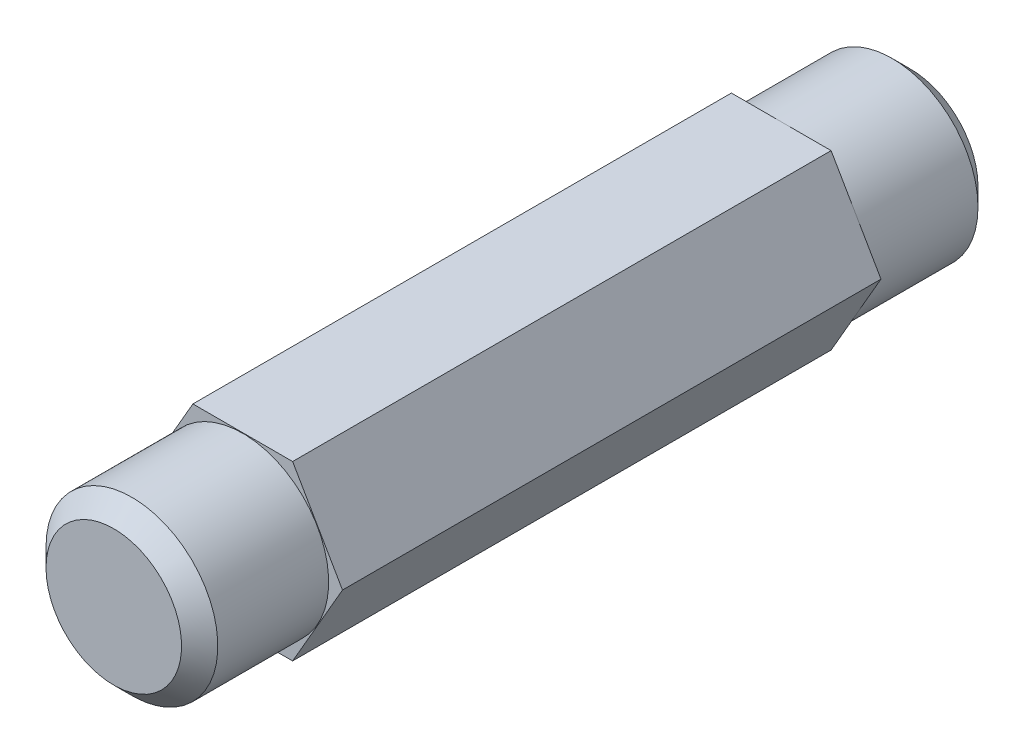
ISO-10303-21;
HEADER;
FILE_DESCRIPTION(('STEP AP214'),'2;1');
FILE_NAME('part.step','',(''),(''),'','','');
FILE_SCHEMA(('AUTOMOTIVE_DESIGN { 1 0 10303 214 1 1 1 1 }'));
ENDSEC;
DATA;
#1=APPLICATION_CONTEXT('core data for automotive mechanical design processes');
#2=APPLICATION_PROTOCOL_DEFINITION('international standard','automotive_design',2000,#1);
#3=PRODUCT_CONTEXT('',#1,'mechanical');
#4=PRODUCT('Part','Part','',(#3));
#5=PRODUCT_RELATED_PRODUCT_CATEGORY('part','',(#4));
#6=PRODUCT_DEFINITION_FORMATION('','',#4);
#7=PRODUCT_DEFINITION_CONTEXT('part definition',#1,'design');
#8=PRODUCT_DEFINITION('design','',#6,#7);
#9=PRODUCT_DEFINITION_SHAPE('','',#8);
#10=(LENGTH_UNIT() NAMED_UNIT(*) SI_UNIT(.MILLI.,.METRE.));
#11=(NAMED_UNIT(*) PLANE_ANGLE_UNIT() SI_UNIT($,.RADIAN.));
#12=(NAMED_UNIT(*) SI_UNIT($,.STERADIAN.) SOLID_ANGLE_UNIT());
#13=UNCERTAINTY_MEASURE_WITH_UNIT(LENGTH_MEASURE(1.E-05),#10,'distance_accuracy_value','');
#14=(GEOMETRIC_REPRESENTATION_CONTEXT(3) GLOBAL_UNCERTAINTY_ASSIGNED_CONTEXT((#13)) GLOBAL_UNIT_ASSIGNED_CONTEXT((#10,
#11,#12)) REPRESENTATION_CONTEXT('',''));
#15=CARTESIAN_POINT('',(0.,0.,0.));
#16=DIRECTION('',(0.,0.,1.));
#17=DIRECTION('',(1.,0.,0.));
#18=AXIS2_PLACEMENT_3D('',#15,#16,#17);
#19=CARTESIAN_POINT('',(0.,0.,21.9583));
#20=DIRECTION('',(0.,0.,1.));
#21=DIRECTION('',(1.,0.,0.));
#22=AXIS2_PLACEMENT_3D('',#19,#20,#21);
#23=PLANE('',#22);
#24=CARTESIAN_POINT('',(0.,0.,21.9582999999943));
#25=DIRECTION('',(0.,0.,-1.));
#26=DIRECTION('',(-1.,0.,0.));
#27=AXIS2_PLACEMENT_3D('',#24,#25,#26);
#28=CIRCLE('',#27,3.73710000002347);
#29=CARTESIAN_POINT('',(-3.73710000002347,0.,21.9582999999943));
#30=VERTEX_POINT('',#29);
#31=EDGE_CURVE('E19',#30,#30,#28,.T.);
#32=ORIENTED_EDGE('',*,*,#31,.F.);
#33=EDGE_LOOP('',(#32));
#34=FACE_BOUND('',#33,.T.);
#35=ADVANCED_FACE('F16',(#34),#23,.T.);
#36=CARTESIAN_POINT('',(0.,0.,-21.9583));
#37=DIRECTION('',(0.,0.,-1.));
#38=DIRECTION('',(-1.,0.,0.));
#39=AXIS2_PLACEMENT_3D('',#36,#37,#38);
#40=PLANE('',#39);
#41=CARTESIAN_POINT('',(0.,0.,-21.9583000000512));
#42=DIRECTION('',(0.,0.,1.));
#43=DIRECTION('',(1.,0.,0.));
#44=AXIS2_PLACEMENT_3D('',#41,#42,#43);
#45=CIRCLE('',#44,3.73709999996663);
#46=CARTESIAN_POINT('',(3.73709999996663,0.,-21.9583000000512));
#47=VERTEX_POINT('',#46);
#48=EDGE_CURVE('E105',#47,#47,#45,.T.);
#49=ORIENTED_EDGE('',*,*,#48,.F.);
#50=EDGE_LOOP('',(#49));
#51=FACE_BOUND('',#50,.T.);
#52=ADVANCED_FACE('F123',(#51),#40,.T.);
#53=CARTESIAN_POINT('',(0.,0.,20.9582999999043));
#54=DIRECTION('',(0.,0.,-1.));
#55=DIRECTION('',(-1.,0.,0.));
#56=AXIS2_PLACEMENT_3D('',#53,#54,#55);
#57=CONICAL_SURFACE('',#56,4.73710000011351,0.785398163397448);
#58=CARTESIAN_POINT('',(0.,0.,20.9583));
#59=DIRECTION('',(0.,0.,-1.));
#60=DIRECTION('',(-1.,0.,0.));
#61=AXIS2_PLACEMENT_3D('',#58,#59,#60);
#62=CIRCLE('',#61,4.7371);
#63=CARTESIAN_POINT('',(-4.7371,0.,20.9583));
#64=VERTEX_POINT('',#63);
#65=EDGE_CURVE('E102',#64,#64,#62,.T.);
#66=ORIENTED_EDGE('',*,*,#65,.F.);
#67=EDGE_LOOP('',(#66));
#68=FACE_BOUND('',#67,.T.);
#69=ORIENTED_EDGE('',*,*,#31,.T.);
#70=EDGE_LOOP('',(#69));
#71=FACE_BOUND('',#70,.T.);
#72=ADVANCED_FACE('F120',(#68,#71),#57,.T.);
#73=CARTESIAN_POINT('',(0.,0.,-20.958300000018));
#74=DIRECTION('',(0.,0.,1.));
#75=DIRECTION('',(1.,0.,0.));
#76=AXIS2_PLACEMENT_3D('',#73,#74,#75);
#77=CONICAL_SURFACE('',#76,4.73709999994298,0.785398163369027);
#78=CARTESIAN_POINT('',(0.,0.,-20.9583));
#79=DIRECTION('',(0.,0.,1.));
#80=DIRECTION('',(1.,0.,0.));
#81=AXIS2_PLACEMENT_3D('',#78,#79,#80);
#82=CIRCLE('',#81,4.7371);
#83=CARTESIAN_POINT('',(4.7371,0.,-20.9583));
#84=VERTEX_POINT('',#83);
#85=EDGE_CURVE('E99',#84,#84,#82,.T.);
#86=ORIENTED_EDGE('',*,*,#85,.F.);
#87=EDGE_LOOP('',(#86));
#88=FACE_BOUND('',#87,.T.);
#89=ORIENTED_EDGE('',*,*,#48,.T.);
#90=EDGE_LOOP('',(#89));
#91=FACE_BOUND('',#90,.T.);
#92=ADVANCED_FACE('F166',(#88,#91),#77,.T.);
#93=CARTESIAN_POINT('',(0.,0.,21.9583));
#94=DIRECTION('',(0.,0.,-1.));
#95=DIRECTION('',(-1.,0.,0.));
#96=AXIS2_PLACEMENT_3D('',#93,#94,#95);
#97=CYLINDRICAL_SURFACE('',#96,4.7371);
#98=CARTESIAN_POINT('',(0.,0.,14.8463));
#99=DIRECTION('',(0.,0.,-1.));
#100=DIRECTION('',(-1.,0.,0.));
#101=AXIS2_PLACEMENT_3D('',#98,#99,#100);
#102=CIRCLE('',#101,4.7371);
#103=CARTESIAN_POINT('',(-4.7371,0.,14.8463));
#104=VERTEX_POINT('',#103);
#105=EDGE_CURVE('E111',#104,#104,#102,.T.);
#106=ORIENTED_EDGE('',*,*,#105,.F.);
#107=EDGE_LOOP('',(#106));
#108=FACE_BOUND('',#107,.T.);
#109=ORIENTED_EDGE('',*,*,#65,.T.);
#110=EDGE_LOOP('',(#109));
#111=FACE_BOUND('',#110,.T.);
#112=ADVANCED_FACE('F162',(#108,#111),#97,.T.);
#113=CARTESIAN_POINT('',(0.,0.,-21.9583));
#114=DIRECTION('',(0.,0.,1.));
#115=DIRECTION('',(1.,0.,0.));
#116=AXIS2_PLACEMENT_3D('',#113,#114,#115);
#117=CYLINDRICAL_SURFACE('',#116,4.7371);
#118=CARTESIAN_POINT('',(0.,0.,-14.8463));
#119=DIRECTION('',(0.,0.,1.));
#120=DIRECTION('',(1.,0.,0.));
#121=AXIS2_PLACEMENT_3D('',#118,#119,#120);
#122=CIRCLE('',#121,4.7371);
#123=CARTESIAN_POINT('',(4.7371,0.,-14.8463));
#124=VERTEX_POINT('',#123);
#125=EDGE_CURVE('E106',#124,#124,#122,.F.);
#126=ORIENTED_EDGE('',*,*,#125,.T.);
#127=EDGE_LOOP('',(#126));
#128=FACE_BOUND('',#127,.T.);
#129=ORIENTED_EDGE('',*,*,#85,.T.);
#130=EDGE_LOOP('',(#129));
#131=FACE_BOUND('',#130,.T.);
#132=ADVANCED_FACE('F159',(#128,#131),#117,.T.);
#133=CARTESIAN_POINT('',(5.49926131403118,0.,14.8463));
#134=DIRECTION('',(-0.866025403784439,-0.5,0.));
#135=DIRECTION('',(0.5,-0.866025403784439,0.));
#136=AXIS2_PLACEMENT_3D('',#133,#134,#135);
#137=PLANE('',#136);
#138=DIRECTION('',(0.,0.,-1.));
#139=VECTOR('',#138,1.);
#140=CARTESIAN_POINT('',(2.74963065701559,4.7625,14.8463));
#141=LINE('',#140,#139);
#142=CARTESIAN_POINT('',(2.74963065701559,4.7625,-14.8463));
#143=VERTEX_POINT('',#142);
#144=CARTESIAN_POINT('',(2.74963065701559,4.7625,14.8463));
#145=VERTEX_POINT('',#144);
#146=EDGE_CURVE('E81',#143,#145,#141,.F.);
#147=ORIENTED_EDGE('',*,*,#146,.T.);
#148=DIRECTION('',(-0.5,0.866025403784439,0.));
#149=VECTOR('',#148,1.);
#150=CARTESIAN_POINT('',(5.49926131403118,0.,14.8463));
#151=LINE('',#150,#149);
#152=CARTESIAN_POINT('',(5.49926131403118,0.,14.8463));
#153=VERTEX_POINT('',#152);
#154=EDGE_CURVE('E86',#153,#145,#151,.T.);
#155=ORIENTED_EDGE('',*,*,#154,.F.);
#156=DIRECTION('',(0.,0.,1.));
#157=VECTOR('',#156,1.);
#158=CARTESIAN_POINT('',(5.49926131403118,0.,14.8463));
#159=LINE('',#158,#157);
#160=CARTESIAN_POINT('',(5.49926131403118,0.,-14.8463));
#161=VERTEX_POINT('',#160);
#162=EDGE_CURVE('E72',#153,#161,#159,.F.);
#163=ORIENTED_EDGE('',*,*,#162,.T.);
#164=DIRECTION('',(-0.5,0.866025403784439,0.));
#165=VECTOR('',#164,1.);
#166=CARTESIAN_POINT('',(5.49926131403118,0.,-14.8463));
#167=LINE('',#166,#165);
#168=EDGE_CURVE('E109',#161,#143,#167,.T.);
#169=ORIENTED_EDGE('',*,*,#168,.T.);
#170=EDGE_LOOP('',(#147,#155,#163,#169));
#171=FACE_BOUND('',#170,.T.);
#172=ADVANCED_FACE('F90',(#171),#137,.F.);
#173=CARTESIAN_POINT('',(-2.74963065701559,-4.7625,14.8463));
#174=DIRECTION('',(0.,1.,0.));
#175=DIRECTION('',(0.,0.,1.));
#176=AXIS2_PLACEMENT_3D('',#173,#174,#175);
#177=PLANE('',#176);
#178=DIRECTION('',(0.,0.,1.));
#179=VECTOR('',#178,1.);
#180=CARTESIAN_POINT('',(2.74963065701559,-4.7625,14.8463));
#181=LINE('',#180,#179);
#182=CARTESIAN_POINT('',(2.74963065701559,-4.7625,-14.8463));
#183=VERTEX_POINT('',#182);
#184=CARTESIAN_POINT('',(2.74963065701559,-4.7625,14.8463));
#185=VERTEX_POINT('',#184);
#186=EDGE_CURVE('E65',#183,#185,#181,.T.);
#187=ORIENTED_EDGE('',*,*,#186,.T.);
#188=DIRECTION('',(1.,0.,0.));
#189=VECTOR('',#188,1.);
#190=CARTESIAN_POINT('',(5.49926131403118,-4.7625,14.8463));
#191=LINE('',#190,#189);
#192=CARTESIAN_POINT('',(-2.74963065701559,-4.7625,14.8463));
#193=VERTEX_POINT('',#192);
#194=EDGE_CURVE('E88',#193,#185,#191,.T.);
#195=ORIENTED_EDGE('',*,*,#194,.F.);
#196=DIRECTION('',(0.,0.,1.));
#197=VECTOR('',#196,1.);
#198=CARTESIAN_POINT('',(-2.74963065701559,-4.7625,14.8463));
#199=LINE('',#198,#197);
#200=CARTESIAN_POINT('',(-2.74963065701559,-4.7625,-14.8463));
#201=VERTEX_POINT('',#200);
#202=EDGE_CURVE('E110',#193,#201,#199,.F.);
#203=ORIENTED_EDGE('',*,*,#202,.T.);
#204=DIRECTION('',(1.,0.,0.));
#205=VECTOR('',#204,1.);
#206=CARTESIAN_POINT('',(5.49926131403118,-4.7625,-14.8463));
#207=LINE('',#206,#205);
#208=EDGE_CURVE('E279',#201,#183,#207,.T.);
#209=ORIENTED_EDGE('',*,*,#208,.T.);
#210=EDGE_LOOP('',(#187,#195,#203,#209));
#211=FACE_BOUND('',#210,.T.);
#212=ADVANCED_FACE('F154',(#211),#177,.F.);
#213=CARTESIAN_POINT('',(2.74963065701559,-4.7625,14.8463));
#214=DIRECTION('',(-0.866025403784439,0.5,0.));
#215=DIRECTION('',(-0.5,-0.866025403784439,0.));
#216=AXIS2_PLACEMENT_3D('',#213,#214,#215);
#217=PLANE('',#216);
#218=ORIENTED_EDGE('',*,*,#162,.F.);
#219=DIRECTION('',(0.5,0.866025403784439,0.));
#220=VECTOR('',#219,1.);
#221=CARTESIAN_POINT('',(2.74963065701559,-4.7625,14.8463));
#222=LINE('',#221,#220);
#223=EDGE_CURVE('E75',#185,#153,#222,.T.);
#224=ORIENTED_EDGE('',*,*,#223,.F.);
#225=ORIENTED_EDGE('',*,*,#186,.F.);
#226=DIRECTION('',(0.5,0.866025403784439,0.));
#227=VECTOR('',#226,1.);
#228=CARTESIAN_POINT('',(2.74963065701559,-4.7625,-14.8463));
#229=LINE('',#228,#227);
#230=EDGE_CURVE('E77',#183,#161,#229,.T.);
#231=ORIENTED_EDGE('',*,*,#230,.T.);
#232=EDGE_LOOP('',(#218,#224,#225,#231));
#233=FACE_BOUND('',#232,.T.);
#234=ADVANCED_FACE('F74',(#233),#217,.F.);
#235=CARTESIAN_POINT('',(2.74963065701559,4.7625,14.8463));
#236=DIRECTION('',(0.,-1.,0.));
#237=DIRECTION('',(0.,0.,-1.));
#238=AXIS2_PLACEMENT_3D('',#235,#236,#237);
#239=PLANE('',#238);
#240=DIRECTION('',(0.,0.,1.));
#241=VECTOR('',#240,1.);
#242=CARTESIAN_POINT('',(-2.74963065701559,4.7625,14.8463));
#243=LINE('',#242,#241);
#244=CARTESIAN_POINT('',(-2.74963065701559,4.7625,-14.8463));
#245=VERTEX_POINT('',#244);
#246=CARTESIAN_POINT('',(-2.74963065701559,4.7625,14.8463));
#247=VERTEX_POINT('',#246);
#248=EDGE_CURVE('E271',#245,#247,#243,.T.);
#249=ORIENTED_EDGE('',*,*,#248,.T.);
#250=DIRECTION('',(1.,0.,0.));
#251=VECTOR('',#250,1.);
#252=CARTESIAN_POINT('',(5.49926131403118,4.7625,14.8463));
#253=LINE('',#252,#251);
#254=EDGE_CURVE('E92',#145,#247,#253,.F.);
#255=ORIENTED_EDGE('',*,*,#254,.F.);
#256=ORIENTED_EDGE('',*,*,#146,.F.);
#257=DIRECTION('',(1.,0.,0.));
#258=VECTOR('',#257,1.);
#259=CARTESIAN_POINT('',(5.49926131403118,4.7625,-14.8463));
#260=LINE('',#259,#258);
#261=EDGE_CURVE('E273',#143,#245,#260,.F.);
#262=ORIENTED_EDGE('',*,*,#261,.T.);
#263=EDGE_LOOP('',(#249,#255,#256,#262));
#264=FACE_BOUND('',#263,.T.);
#265=ADVANCED_FACE('F147',(#264),#239,.F.);
#266=CARTESIAN_POINT('',(5.49926131403118,0.,14.8463));
#267=DIRECTION('',(0.,0.,1.));
#268=DIRECTION('',(1.,0.,0.));
#269=AXIS2_PLACEMENT_3D('',#266,#267,#268);
#270=PLANE('',#269);
#271=ORIENTED_EDGE('',*,*,#105,.T.);
#272=EDGE_LOOP('',(#271));
#273=FACE_BOUND('',#272,.T.);
#274=DIRECTION('',(-0.5,0.866025403784439,0.));
#275=VECTOR('',#274,1.);
#276=CARTESIAN_POINT('',(-5.49926131403119,0.,14.8463));
#277=LINE('',#276,#275);
#278=CARTESIAN_POINT('',(-5.49926131403119,0.,14.8463));
#279=VERTEX_POINT('',#278);
#280=EDGE_CURVE('E113',#279,#193,#277,.F.);
#281=ORIENTED_EDGE('',*,*,#280,.T.);
#282=ORIENTED_EDGE('',*,*,#194,.T.);
#283=ORIENTED_EDGE('',*,*,#223,.T.);
#284=ORIENTED_EDGE('',*,*,#154,.T.);
#285=ORIENTED_EDGE('',*,*,#254,.T.);
#286=DIRECTION('',(0.5,0.866025403784439,0.));
#287=VECTOR('',#286,1.);
#288=CARTESIAN_POINT('',(-2.74963065701559,4.7625,14.8463));
#289=LINE('',#288,#287);
#290=EDGE_CURVE('E275',#247,#279,#289,.F.);
#291=ORIENTED_EDGE('',*,*,#290,.T.);
#292=EDGE_LOOP('',(#281,#282,#283,#284,#285,#291));
#293=FACE_BOUND('',#292,.T.);
#294=ADVANCED_FACE('F85',(#273,#293),#270,.T.);
#295=CARTESIAN_POINT('',(-5.49926131403119,0.,14.8463));
#296=DIRECTION('',(0.866025403784439,0.5,0.));
#297=DIRECTION('',(-0.5,0.866025403784439,0.));
#298=AXIS2_PLACEMENT_3D('',#295,#296,#297);
#299=PLANE('',#298);
#300=ORIENTED_EDGE('',*,*,#202,.F.);
#301=ORIENTED_EDGE('',*,*,#280,.F.);
#302=DIRECTION('',(0.,0.,1.));
#303=VECTOR('',#302,1.);
#304=CARTESIAN_POINT('',(-5.49926131403119,0.,14.8463));
#305=LINE('',#304,#303);
#306=CARTESIAN_POINT('',(-5.49926131403119,0.,-14.8463));
#307=VERTEX_POINT('',#306);
#308=EDGE_CURVE('E25',#279,#307,#305,.F.);
#309=ORIENTED_EDGE('',*,*,#308,.T.);
#310=DIRECTION('',(0.5,-0.866025403784439,0.));
#311=VECTOR('',#310,1.);
#312=CARTESIAN_POINT('',(-5.49926131403119,0.,-14.8463));
#313=LINE('',#312,#311);
#314=EDGE_CURVE('E33',#307,#201,#313,.T.);
#315=ORIENTED_EDGE('',*,*,#314,.T.);
#316=EDGE_LOOP('',(#300,#301,#309,#315));
#317=FACE_BOUND('',#316,.T.);
#318=ADVANCED_FACE('F138',(#317),#299,.F.);
#319=CARTESIAN_POINT('',(5.49926131403118,0.,-14.8463));
#320=DIRECTION('',(0.,0.,1.));
#321=DIRECTION('',(1.,0.,0.));
#322=AXIS2_PLACEMENT_3D('',#319,#320,#321);
#323=PLANE('',#322);
#324=ORIENTED_EDGE('',*,*,#208,.F.);
#325=ORIENTED_EDGE('',*,*,#314,.F.);
#326=DIRECTION('',(0.5,0.866025403784439,0.));
#327=VECTOR('',#326,1.);
#328=CARTESIAN_POINT('',(-2.74963065701559,4.7625,-14.8463));
#329=LINE('',#328,#327);
#330=EDGE_CURVE('E11',#307,#245,#329,.T.);
#331=ORIENTED_EDGE('',*,*,#330,.T.);
#332=ORIENTED_EDGE('',*,*,#261,.F.);
#333=ORIENTED_EDGE('',*,*,#168,.F.);
#334=ORIENTED_EDGE('',*,*,#230,.F.);
#335=EDGE_LOOP('',(#324,#325,#331,#332,#333,#334));
#336=FACE_BOUND('',#335,.T.);
#337=ORIENTED_EDGE('',*,*,#125,.F.);
#338=EDGE_LOOP('',(#337));
#339=FACE_BOUND('',#338,.T.);
#340=ADVANCED_FACE('F131',(#336,#339),#323,.F.);
#341=CARTESIAN_POINT('',(-2.74963065701559,4.7625,14.8463));
#342=DIRECTION('',(0.866025403784439,-0.5,0.));
#343=DIRECTION('',(0.5,0.866025403784439,0.));
#344=AXIS2_PLACEMENT_3D('',#341,#342,#343);
#345=PLANE('',#344);
#346=ORIENTED_EDGE('',*,*,#308,.F.);
#347=ORIENTED_EDGE('',*,*,#290,.F.);
#348=ORIENTED_EDGE('',*,*,#248,.F.);
#349=ORIENTED_EDGE('',*,*,#330,.F.);
#350=EDGE_LOOP('',(#346,#347,#348,#349));
#351=FACE_BOUND('',#350,.T.);
#352=ADVANCED_FACE('F129',(#351),#345,.F.);
#353=CLOSED_SHELL('',(#35,#52,#72,#92,#112,#132,#172,#212,#234,#265,#294,#318,#340,#352));
#354=MANIFOLD_SOLID_BREP('B1',#353);
#355=ADVANCED_BREP_SHAPE_REPRESENTATION('',(#18,#354),#14);
#356=SHAPE_DEFINITION_REPRESENTATION(#9,#355);
ENDSEC;
END-ISO-10303-21;
